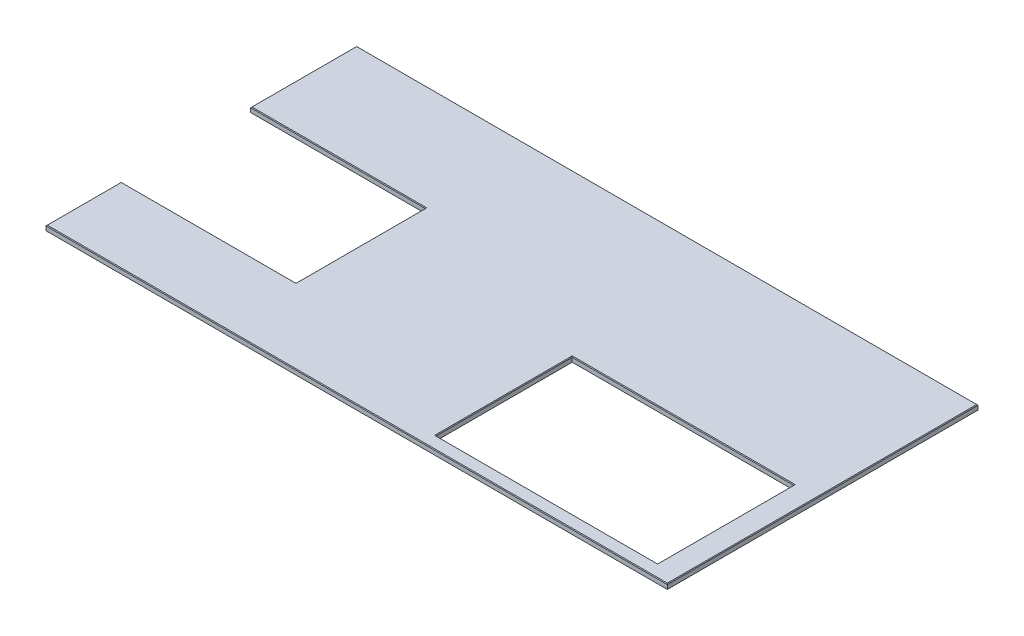
ISO-10303-21;
HEADER;
FILE_DESCRIPTION(('STEP AP214'),'2;1');
FILE_NAME('part.step','',(''),(''),'','','');
FILE_SCHEMA(('AUTOMOTIVE_DESIGN { 1 0 10303 214 1 1 1 1 }'));
ENDSEC;
DATA;
#1=APPLICATION_CONTEXT('core data for automotive mechanical design processes');
#2=APPLICATION_PROTOCOL_DEFINITION('international standard','automotive_design',2000,#1);
#3=PRODUCT_CONTEXT('',#1,'mechanical');
#4=PRODUCT('Part','Part','',(#3));
#5=PRODUCT_RELATED_PRODUCT_CATEGORY('part','',(#4));
#6=PRODUCT_DEFINITION_FORMATION('','',#4);
#7=PRODUCT_DEFINITION_CONTEXT('part definition',#1,'design');
#8=PRODUCT_DEFINITION('design','',#6,#7);
#9=PRODUCT_DEFINITION_SHAPE('','',#8);
#10=(LENGTH_UNIT() NAMED_UNIT(*) SI_UNIT(.MILLI.,.METRE.));
#11=(NAMED_UNIT(*) PLANE_ANGLE_UNIT() SI_UNIT($,.RADIAN.));
#12=(NAMED_UNIT(*) SI_UNIT($,.STERADIAN.) SOLID_ANGLE_UNIT());
#13=UNCERTAINTY_MEASURE_WITH_UNIT(LENGTH_MEASURE(1.E-05),#10,'distance_accuracy_value','');
#14=(GEOMETRIC_REPRESENTATION_CONTEXT(3) GLOBAL_UNCERTAINTY_ASSIGNED_CONTEXT((#13)) GLOBAL_UNIT_ASSIGNED_CONTEXT((#10,
#11,#12)) REPRESENTATION_CONTEXT('',''));
#15=CARTESIAN_POINT('',(0.,0.,0.));
#16=DIRECTION('',(0.,0.,1.));
#17=DIRECTION('',(1.,0.,0.));
#18=AXIS2_PLACEMENT_3D('',#15,#16,#17);
#19=CARTESIAN_POINT('',(0.,-19.05,0.));
#20=DIRECTION('',(0.,0.,1.));
#21=DIRECTION('',(1.,0.,0.));
#22=AXIS2_PLACEMENT_3D('',#19,#20,#21);
#23=PLANE('',#22);
#24=DIRECTION('',(0.,1.,0.));
#25=VECTOR('',#24,1.);
#26=CARTESIAN_POINT('',(2438.4,-19.05,0.));
#27=LINE('',#26,#25);
#28=CARTESIAN_POINT('',(2438.4,-19.05,0.));
#29=VERTEX_POINT('',#28);
#30=CARTESIAN_POINT('',(2438.4,-2.53999999999999,0.));
#31=VERTEX_POINT('',#30);
#32=EDGE_CURVE('E228',#29,#31,#27,.T.);
#33=ORIENTED_EDGE('',*,*,#32,.T.);
#34=DIRECTION('',(-1.,0.,0.));
#35=VECTOR('',#34,1.);
#36=CARTESIAN_POINT('',(0.,-2.53999999999999,0.));
#37=LINE('',#36,#35);
#38=CARTESIAN_POINT('',(0.,-2.53999999999999,0.));
#39=VERTEX_POINT('',#38);
#40=EDGE_CURVE('E293',#31,#39,#37,.T.);
#41=ORIENTED_EDGE('',*,*,#40,.T.);
#42=DIRECTION('',(0.,1.,0.));
#43=VECTOR('',#42,1.);
#44=CARTESIAN_POINT('',(0.,-19.05,0.));
#45=LINE('',#44,#43);
#46=CARTESIAN_POINT('',(0.,-19.05,0.));
#47=VERTEX_POINT('',#46);
#48=EDGE_CURVE('E229',#47,#39,#45,.T.);
#49=ORIENTED_EDGE('',*,*,#48,.F.);
#50=DIRECTION('',(1.,0.,0.));
#51=VECTOR('',#50,1.);
#52=CARTESIAN_POINT('',(0.,-19.05,0.));
#53=LINE('',#52,#51);
#54=EDGE_CURVE('E201',#47,#29,#53,.T.);
#55=ORIENTED_EDGE('',*,*,#54,.T.);
#56=EDGE_LOOP('',(#33,#41,#49,#55));
#57=FACE_BOUND('',#56,.T.);
#58=ADVANCED_FACE('F40',(#57),#23,.T.);
#59=CARTESIAN_POINT('',(1.13148179390222E-13,-19.05,-295.275));
#60=DIRECTION('',(-1.,0.,0.));
#61=DIRECTION('',(0.,0.,1.));
#62=AXIS2_PLACEMENT_3D('',#59,#60,#61);
#63=PLANE('',#62);
#64=ORIENTED_EDGE('',*,*,#48,.T.);
#65=DIRECTION('',(0.,0.,-1.));
#66=VECTOR('',#65,1.);
#67=CARTESIAN_POINT('',(1.13148179390222E-13,-2.53999999999999,-295.275));
#68=LINE('',#67,#66);
#69=CARTESIAN_POINT('',(1.13148179390222E-13,-2.53999999999999,-295.275));
#70=VERTEX_POINT('',#69);
#71=EDGE_CURVE('E278',#39,#70,#68,.T.);
#72=ORIENTED_EDGE('',*,*,#71,.T.);
#73=DIRECTION('',(0.,1.,0.));
#74=VECTOR('',#73,1.);
#75=CARTESIAN_POINT('',(1.13148179390222E-13,-19.05,-295.275));
#76=LINE('',#75,#74);
#77=CARTESIAN_POINT('',(1.13148179390222E-13,-19.05,-295.275));
#78=VERTEX_POINT('',#77);
#79=EDGE_CURVE('E233',#78,#70,#76,.T.);
#80=ORIENTED_EDGE('',*,*,#79,.F.);
#81=DIRECTION('',(0.,0.,1.));
#82=VECTOR('',#81,1.);
#83=CARTESIAN_POINT('',(1.13148179390222E-13,-19.05,-295.275));
#84=LINE('',#83,#82);
#85=EDGE_CURVE('E225',#78,#47,#84,.T.);
#86=ORIENTED_EDGE('',*,*,#85,.T.);
#87=EDGE_LOOP('',(#64,#72,#80,#86));
#88=FACE_BOUND('',#87,.T.);
#89=ADVANCED_FACE('F351',(#88),#63,.T.);
#90=CARTESIAN_POINT('',(1.13148179390222E-13,-19.05,-295.275));
#91=DIRECTION('',(0.,0.,-1.));
#92=DIRECTION('',(-1.,0.,0.));
#93=AXIS2_PLACEMENT_3D('',#90,#91,#92);
#94=PLANE('',#93);
#95=ORIENTED_EDGE('',*,*,#79,.T.);
#96=DIRECTION('',(1.,0.,0.));
#97=VECTOR('',#96,1.);
#98=CARTESIAN_POINT('',(1.13148179390222E-13,-2.53999999999999,-295.275));
#99=LINE('',#98,#97);
#100=CARTESIAN_POINT('',(685.8,-2.53999999999999,-295.275));
#101=VERTEX_POINT('',#100);
#102=EDGE_CURVE('E281',#70,#101,#99,.T.);
#103=ORIENTED_EDGE('',*,*,#102,.T.);
#104=DIRECTION('',(0.,1.,0.));
#105=VECTOR('',#104,1.);
#106=CARTESIAN_POINT('',(685.8,-19.05,-295.275));
#107=LINE('',#106,#105);
#108=CARTESIAN_POINT('',(685.8,-19.05,-295.275));
#109=VERTEX_POINT('',#108);
#110=EDGE_CURVE('E236',#109,#101,#107,.T.);
#111=ORIENTED_EDGE('',*,*,#110,.F.);
#112=DIRECTION('',(-1.,0.,0.));
#113=VECTOR('',#112,1.);
#114=CARTESIAN_POINT('',(1.13148179390222E-13,-19.05,-295.275));
#115=LINE('',#114,#113);
#116=EDGE_CURVE('E222',#109,#78,#115,.T.);
#117=ORIENTED_EDGE('',*,*,#116,.T.);
#118=EDGE_LOOP('',(#95,#103,#111,#117));
#119=FACE_BOUND('',#118,.T.);
#120=ADVANCED_FACE('F358',(#119),#94,.T.);
#121=CARTESIAN_POINT('',(685.8,-19.05,-803.275));
#122=DIRECTION('',(-1.,0.,0.));
#123=DIRECTION('',(0.,0.,1.));
#124=AXIS2_PLACEMENT_3D('',#121,#122,#123);
#125=PLANE('',#124);
#126=ORIENTED_EDGE('',*,*,#110,.T.);
#127=DIRECTION('',(0.,0.,-1.));
#128=VECTOR('',#127,1.);
#129=CARTESIAN_POINT('',(685.8,-2.53999999999999,-803.275));
#130=LINE('',#129,#128);
#131=CARTESIAN_POINT('',(685.8,-2.53999999999999,-803.275));
#132=VERTEX_POINT('',#131);
#133=EDGE_CURVE('E283',#101,#132,#130,.T.);
#134=ORIENTED_EDGE('',*,*,#133,.T.);
#135=DIRECTION('',(0.,1.,0.));
#136=VECTOR('',#135,1.);
#137=CARTESIAN_POINT('',(685.8,-19.05,-803.275));
#138=LINE('',#137,#136);
#139=CARTESIAN_POINT('',(685.8,-19.05,-803.275));
#140=VERTEX_POINT('',#139);
#141=EDGE_CURVE('E239',#140,#132,#138,.T.);
#142=ORIENTED_EDGE('',*,*,#141,.F.);
#143=DIRECTION('',(0.,0.,1.));
#144=VECTOR('',#143,1.);
#145=CARTESIAN_POINT('',(685.8,-19.05,-803.275));
#146=LINE('',#145,#144);
#147=EDGE_CURVE('E219',#140,#109,#146,.T.);
#148=ORIENTED_EDGE('',*,*,#147,.T.);
#149=EDGE_LOOP('',(#126,#134,#142,#148));
#150=FACE_BOUND('',#149,.T.);
#151=ADVANCED_FACE('F555',(#150),#125,.T.);
#152=CARTESIAN_POINT('',(0.,-19.05,-803.275));
#153=DIRECTION('',(0.,0.,1.));
#154=DIRECTION('',(1.,0.,0.));
#155=AXIS2_PLACEMENT_3D('',#152,#153,#154);
#156=PLANE('',#155);
#157=ORIENTED_EDGE('',*,*,#141,.T.);
#158=DIRECTION('',(-1.,0.,0.));
#159=VECTOR('',#158,1.);
#160=CARTESIAN_POINT('',(0.,-2.53999999999999,-803.275));
#161=LINE('',#160,#159);
#162=CARTESIAN_POINT('',(0.,-2.53999999999999,-803.275));
#163=VERTEX_POINT('',#162);
#164=EDGE_CURVE('E285',#132,#163,#161,.T.);
#165=ORIENTED_EDGE('',*,*,#164,.T.);
#166=DIRECTION('',(0.,1.,0.));
#167=VECTOR('',#166,1.);
#168=CARTESIAN_POINT('',(0.,-19.05,-803.275));
#169=LINE('',#168,#167);
#170=CARTESIAN_POINT('',(0.,-19.05,-803.275));
#171=VERTEX_POINT('',#170);
#172=EDGE_CURVE('E242',#171,#163,#169,.T.);
#173=ORIENTED_EDGE('',*,*,#172,.F.);
#174=DIRECTION('',(1.,0.,0.));
#175=VECTOR('',#174,1.);
#176=CARTESIAN_POINT('',(0.,-19.05,-803.275));
#177=LINE('',#176,#175);
#178=EDGE_CURVE('E216',#171,#140,#177,.T.);
#179=ORIENTED_EDGE('',*,*,#178,.T.);
#180=EDGE_LOOP('',(#157,#165,#173,#179));
#181=FACE_BOUND('',#180,.T.);
#182=ADVANCED_FACE('F545',(#181),#156,.T.);
#183=CARTESIAN_POINT('',(-2.29534139493609E-13,-19.05,-1219.2));
#184=DIRECTION('',(-1.,0.,0.));
#185=DIRECTION('',(0.,0.,1.));
#186=AXIS2_PLACEMENT_3D('',#183,#184,#185);
#187=PLANE('',#186);
#188=ORIENTED_EDGE('',*,*,#172,.T.);
#189=DIRECTION('',(0.,0.,-1.));
#190=VECTOR('',#189,1.);
#191=CARTESIAN_POINT('',(-2.29534139493609E-13,-2.53999999999999,-1219.2));
#192=LINE('',#191,#190);
#193=CARTESIAN_POINT('',(-2.29534139493609E-13,-2.53999999999999,-1219.2));
#194=VERTEX_POINT('',#193);
#195=EDGE_CURVE('E287',#163,#194,#192,.T.);
#196=ORIENTED_EDGE('',*,*,#195,.T.);
#197=DIRECTION('',(0.,1.,0.));
#198=VECTOR('',#197,1.);
#199=CARTESIAN_POINT('',(-2.29534139493609E-13,-19.05,-1219.2));
#200=LINE('',#199,#198);
#201=CARTESIAN_POINT('',(-2.29534139493609E-13,-19.05,-1219.2));
#202=VERTEX_POINT('',#201);
#203=EDGE_CURVE('E245',#202,#194,#200,.T.);
#204=ORIENTED_EDGE('',*,*,#203,.F.);
#205=DIRECTION('',(0.,0.,1.));
#206=VECTOR('',#205,1.);
#207=CARTESIAN_POINT('',(-2.29534139493609E-13,-19.05,-1219.2));
#208=LINE('',#207,#206);
#209=EDGE_CURVE('E213',#202,#171,#208,.T.);
#210=ORIENTED_EDGE('',*,*,#209,.T.);
#211=EDGE_LOOP('',(#188,#196,#204,#210));
#212=FACE_BOUND('',#211,.T.);
#213=ADVANCED_FACE('F536',(#212),#187,.T.);
#214=CARTESIAN_POINT('',(2438.4,-19.05,-1219.2));
#215=DIRECTION('',(0.,0.,-1.));
#216=DIRECTION('',(-1.,0.,0.));
#217=AXIS2_PLACEMENT_3D('',#214,#215,#216);
#218=PLANE('',#217);
#219=ORIENTED_EDGE('',*,*,#203,.T.);
#220=DIRECTION('',(1.,0.,0.));
#221=VECTOR('',#220,1.);
#222=CARTESIAN_POINT('',(2438.4,-2.53999999999999,-1219.2));
#223=LINE('',#222,#221);
#224=CARTESIAN_POINT('',(2438.4,-2.53999999999999,-1219.2));
#225=VERTEX_POINT('',#224);
#226=EDGE_CURVE('E289',#194,#225,#223,.T.);
#227=ORIENTED_EDGE('',*,*,#226,.T.);
#228=DIRECTION('',(0.,1.,0.));
#229=VECTOR('',#228,1.);
#230=CARTESIAN_POINT('',(2438.4,-19.05,-1219.2));
#231=LINE('',#230,#229);
#232=CARTESIAN_POINT('',(2438.4,-19.05,-1219.2));
#233=VERTEX_POINT('',#232);
#234=EDGE_CURVE('E248',#233,#225,#231,.T.);
#235=ORIENTED_EDGE('',*,*,#234,.F.);
#236=DIRECTION('',(-1.,0.,0.));
#237=VECTOR('',#236,1.);
#238=CARTESIAN_POINT('',(2438.4,-19.05,-1219.2));
#239=LINE('',#238,#237);
#240=EDGE_CURVE('E210',#233,#202,#239,.T.);
#241=ORIENTED_EDGE('',*,*,#240,.T.);
#242=EDGE_LOOP('',(#219,#227,#235,#241));
#243=FACE_BOUND('',#242,.T.);
#244=ADVANCED_FACE('F527',(#243),#218,.T.);
#245=CARTESIAN_POINT('',(2438.4,-19.05,0.));
#246=DIRECTION('',(1.,0.,0.));
#247=DIRECTION('',(0.,0.,-1.));
#248=AXIS2_PLACEMENT_3D('',#245,#246,#247);
#249=PLANE('',#248);
#250=ORIENTED_EDGE('',*,*,#234,.T.);
#251=DIRECTION('',(0.,0.,1.));
#252=VECTOR('',#251,1.);
#253=CARTESIAN_POINT('',(2438.4,-2.53999999999999,0.));
#254=LINE('',#253,#252);
#255=EDGE_CURVE('E291',#225,#31,#254,.T.);
#256=ORIENTED_EDGE('',*,*,#255,.T.);
#257=ORIENTED_EDGE('',*,*,#32,.F.);
#258=DIRECTION('',(0.,0.,-1.));
#259=VECTOR('',#258,1.);
#260=CARTESIAN_POINT('',(2438.4,-19.05,0.));
#261=LINE('',#260,#259);
#262=EDGE_CURVE('E207',#29,#233,#261,.T.);
#263=ORIENTED_EDGE('',*,*,#262,.T.);
#264=EDGE_LOOP('',(#250,#256,#257,#263));
#265=FACE_BOUND('',#264,.T.);
#266=ADVANCED_FACE('F363',(#265),#249,.T.);
#267=CARTESIAN_POINT('',(0.,-19.05,0.));
#268=DIRECTION('',(0.,1.,0.));
#269=DIRECTION('',(0.,0.,1.));
#270=AXIS2_PLACEMENT_3D('',#267,#268,#269);
#271=PLANE('',#270);
#272=DIRECTION('',(0.,0.,-1.));
#273=VECTOR('',#272,1.);
#274=CARTESIAN_POINT('',(2349.4365,-19.05,-585.724));
#275=LINE('',#274,#273);
#276=CARTESIAN_POINT('',(2349.4365,-19.05,-50.8));
#277=VERTEX_POINT('',#276);
#278=CARTESIAN_POINT('',(2349.4365,-19.05,-585.724));
#279=VERTEX_POINT('',#278);
#280=EDGE_CURVE('E178',#277,#279,#275,.T.);
#281=ORIENTED_EDGE('',*,*,#280,.T.);
#282=DIRECTION('',(-1.,0.,0.));
#283=VECTOR('',#282,1.);
#284=CARTESIAN_POINT('',(1479.4865,-19.05,-585.724));
#285=LINE('',#284,#283);
#286=CARTESIAN_POINT('',(1479.4865,-19.05,-585.724));
#287=VERTEX_POINT('',#286);
#288=EDGE_CURVE('E171',#279,#287,#285,.T.);
#289=ORIENTED_EDGE('',*,*,#288,.T.);
#290=DIRECTION('',(0.,0.,1.));
#291=VECTOR('',#290,1.);
#292=CARTESIAN_POINT('',(1479.4865,-19.05,-50.8));
#293=LINE('',#292,#291);
#294=CARTESIAN_POINT('',(1479.4865,-19.05,-50.8));
#295=VERTEX_POINT('',#294);
#296=EDGE_CURVE('E182',#287,#295,#293,.T.);
#297=ORIENTED_EDGE('',*,*,#296,.T.);
#298=DIRECTION('',(1.,0.,0.));
#299=VECTOR('',#298,1.);
#300=CARTESIAN_POINT('',(1479.4865,-19.05,-50.8));
#301=LINE('',#300,#299);
#302=EDGE_CURVE('E186',#295,#277,#301,.T.);
#303=ORIENTED_EDGE('',*,*,#302,.T.);
#304=EDGE_LOOP('',(#281,#289,#297,#303));
#305=FACE_BOUND('',#304,.T.);
#306=ORIENTED_EDGE('',*,*,#54,.F.);
#307=ORIENTED_EDGE('',*,*,#85,.F.);
#308=ORIENTED_EDGE('',*,*,#116,.F.);
#309=ORIENTED_EDGE('',*,*,#147,.F.);
#310=ORIENTED_EDGE('',*,*,#178,.F.);
#311=ORIENTED_EDGE('',*,*,#209,.F.);
#312=ORIENTED_EDGE('',*,*,#240,.F.);
#313=ORIENTED_EDGE('',*,*,#262,.F.);
#314=EDGE_LOOP('',(#306,#307,#308,#309,#310,#311,#312,#313));
#315=FACE_BOUND('',#314,.T.);
#316=ADVANCED_FACE('F188',(#305,#315),#271,.F.);
#317=CARTESIAN_POINT('',(0.,0.,0.));
#318=DIRECTION('',(0.,1.,0.));
#319=DIRECTION('',(0.,0.,1.));
#320=AXIS2_PLACEMENT_3D('',#317,#318,#319);
#321=PLANE('',#320);
#322=DIRECTION('',(-1.,0.,0.));
#323=VECTOR('',#322,1.);
#324=CARTESIAN_POINT('',(0.,0.,-292.735));
#325=LINE('',#324,#323);
#326=CARTESIAN_POINT('',(688.34,0.,-292.735));
#327=VERTEX_POINT('',#326);
#328=CARTESIAN_POINT('',(2.5400000000001,0.,-292.735));
#329=VERTEX_POINT('',#328);
#330=EDGE_CURVE('E273',#327,#329,#325,.T.);
#331=ORIENTED_EDGE('',*,*,#330,.T.);
#332=DIRECTION('',(0.,0.,1.));
#333=VECTOR('',#332,1.);
#334=CARTESIAN_POINT('',(2.53999999999999,0.,0.));
#335=LINE('',#334,#333);
#336=CARTESIAN_POINT('',(2.53999999999999,0.,-2.53999999999999));
#337=VERTEX_POINT('',#336);
#338=EDGE_CURVE('E275',#329,#337,#335,.T.);
#339=ORIENTED_EDGE('',*,*,#338,.T.);
#340=DIRECTION('',(1.,0.,0.));
#341=VECTOR('',#340,1.);
#342=CARTESIAN_POINT('',(0.,0.,-2.53999999999999));
#343=LINE('',#342,#341);
#344=CARTESIAN_POINT('',(2435.86,0.,-2.53999999999999));
#345=VERTEX_POINT('',#344);
#346=EDGE_CURVE('E261',#337,#345,#343,.T.);
#347=ORIENTED_EDGE('',*,*,#346,.T.);
#348=DIRECTION('',(0.,0.,-1.));
#349=VECTOR('',#348,1.);
#350=CARTESIAN_POINT('',(2435.86,0.,0.));
#351=LINE('',#350,#349);
#352=CARTESIAN_POINT('',(2435.86,0.,-1216.66));
#353=VERTEX_POINT('',#352);
#354=EDGE_CURVE('E263',#345,#353,#351,.T.);
#355=ORIENTED_EDGE('',*,*,#354,.T.);
#356=DIRECTION('',(-1.,0.,0.));
#357=VECTOR('',#356,1.);
#358=CARTESIAN_POINT('',(0.,0.,-1216.66));
#359=LINE('',#358,#357);
#360=CARTESIAN_POINT('',(2.53999999999976,0.,-1216.66));
#361=VERTEX_POINT('',#360);
#362=EDGE_CURVE('E265',#353,#361,#359,.T.);
#363=ORIENTED_EDGE('',*,*,#362,.T.);
#364=DIRECTION('',(0.,0.,1.));
#365=VECTOR('',#364,1.);
#366=CARTESIAN_POINT('',(2.54000000000058,0.,0.));
#367=LINE('',#366,#365);
#368=CARTESIAN_POINT('',(2.54000000000004,0.,-805.815));
#369=VERTEX_POINT('',#368);
#370=EDGE_CURVE('E267',#361,#369,#367,.T.);
#371=ORIENTED_EDGE('',*,*,#370,.T.);
#372=DIRECTION('',(1.,0.,0.));
#373=VECTOR('',#372,1.);
#374=CARTESIAN_POINT('',(0.,0.,-805.815));
#375=LINE('',#374,#373);
#376=CARTESIAN_POINT('',(688.34,0.,-805.815));
#377=VERTEX_POINT('',#376);
#378=EDGE_CURVE('E269',#369,#377,#375,.T.);
#379=ORIENTED_EDGE('',*,*,#378,.T.);
#380=DIRECTION('',(0.,0.,1.));
#381=VECTOR('',#380,1.);
#382=CARTESIAN_POINT('',(688.34,0.,-1.50435219836709E-13));
#383=LINE('',#382,#381);
#384=EDGE_CURVE('E271',#377,#327,#383,.T.);
#385=ORIENTED_EDGE('',*,*,#384,.T.);
#386=EDGE_LOOP('',(#331,#339,#347,#355,#363,#371,#379,#385));
#387=FACE_BOUND('',#386,.T.);
#388=DIRECTION('',(-1.,0.,0.));
#389=VECTOR('',#388,1.);
#390=CARTESIAN_POINT('',(1479.4865,0.,-48.26));
#391=LINE('',#390,#389);
#392=CARTESIAN_POINT('',(2351.9765,0.,-48.26));
#393=VERTEX_POINT('',#392);
#394=CARTESIAN_POINT('',(1476.9465,0.,-48.26));
#395=VERTEX_POINT('',#394);
#396=EDGE_CURVE('E256',#393,#395,#391,.T.);
#397=ORIENTED_EDGE('',*,*,#396,.T.);
#398=DIRECTION('',(0.,0.,-1.));
#399=VECTOR('',#398,1.);
#400=CARTESIAN_POINT('',(1476.9465,0.,-585.724));
#401=LINE('',#400,#399);
#402=CARTESIAN_POINT('',(1476.9465,0.,-588.264));
#403=VERTEX_POINT('',#402);
#404=EDGE_CURVE('E258',#395,#403,#401,.T.);
#405=ORIENTED_EDGE('',*,*,#404,.T.);
#406=DIRECTION('',(1.,0.,0.));
#407=VECTOR('',#406,1.);
#408=CARTESIAN_POINT('',(2349.4365,0.,-588.264));
#409=LINE('',#408,#407);
#410=CARTESIAN_POINT('',(2351.9765,0.,-588.264));
#411=VERTEX_POINT('',#410);
#412=EDGE_CURVE('E232',#403,#411,#409,.T.);
#413=ORIENTED_EDGE('',*,*,#412,.T.);
#414=DIRECTION('',(0.,0.,1.));
#415=VECTOR('',#414,1.);
#416=CARTESIAN_POINT('',(2351.9765,0.,-50.8));
#417=LINE('',#416,#415);
#418=EDGE_CURVE('E254',#411,#393,#417,.T.);
#419=ORIENTED_EDGE('',*,*,#418,.T.);
#420=EDGE_LOOP('',(#397,#405,#413,#419));
#421=FACE_BOUND('',#420,.T.);
#422=ADVANCED_FACE('F333',(#387,#421),#321,.T.);
#423=CARTESIAN_POINT('',(1479.4865,-19.05,-585.724));
#424=DIRECTION('',(0.,0.,-1.));
#425=DIRECTION('',(-1.,0.,0.));
#426=AXIS2_PLACEMENT_3D('',#423,#424,#425);
#427=PLANE('',#426);
#428=DIRECTION('',(0.,1.,0.));
#429=VECTOR('',#428,1.);
#430=CARTESIAN_POINT('',(2349.4365,-19.05,-585.724));
#431=LINE('',#430,#429);
#432=CARTESIAN_POINT('',(2349.4365,-2.53999999999999,-585.724));
#433=VERTEX_POINT('',#432);
#434=EDGE_CURVE('E199',#279,#433,#431,.T.);
#435=ORIENTED_EDGE('',*,*,#434,.T.);
#436=DIRECTION('',(-1.,0.,0.));
#437=VECTOR('',#436,1.);
#438=CARTESIAN_POINT('',(1479.4865,-2.53999999999999,-585.724));
#439=LINE('',#438,#437);
#440=CARTESIAN_POINT('',(1479.4865,-2.53999999999999,-585.724));
#441=VERTEX_POINT('',#440);
#442=EDGE_CURVE('E11',#433,#441,#439,.T.);
#443=ORIENTED_EDGE('',*,*,#442,.T.);
#444=DIRECTION('',(0.,1.,0.));
#445=VECTOR('',#444,1.);
#446=CARTESIAN_POINT('',(1479.4865,-19.05,-585.724));
#447=LINE('',#446,#445);
#448=EDGE_CURVE('E167',#287,#441,#447,.T.);
#449=ORIENTED_EDGE('',*,*,#448,.F.);
#450=ORIENTED_EDGE('',*,*,#288,.F.);
#451=EDGE_LOOP('',(#435,#443,#449,#450));
#452=FACE_BOUND('',#451,.T.);
#453=ADVANCED_FACE('F169',(#452),#427,.F.);
#454=CARTESIAN_POINT('',(2349.4365,-19.05,-585.724));
#455=DIRECTION('',(1.,0.,0.));
#456=DIRECTION('',(0.,0.,-1.));
#457=AXIS2_PLACEMENT_3D('',#454,#455,#456);
#458=PLANE('',#457);
#459=DIRECTION('',(0.,1.,0.));
#460=VECTOR('',#459,1.);
#461=CARTESIAN_POINT('',(2349.4365,-19.05,-50.8));
#462=LINE('',#461,#460);
#463=CARTESIAN_POINT('',(2349.4365,-2.53999999999999,-50.8));
#464=VERTEX_POINT('',#463);
#465=EDGE_CURVE('E202',#277,#464,#462,.T.);
#466=ORIENTED_EDGE('',*,*,#465,.T.);
#467=DIRECTION('',(0.,0.,-1.));
#468=VECTOR('',#467,1.);
#469=CARTESIAN_POINT('',(2349.4365,-2.53999999999999,-585.724));
#470=LINE('',#469,#468);
#471=EDGE_CURVE('E50',#464,#433,#470,.T.);
#472=ORIENTED_EDGE('',*,*,#471,.T.);
#473=ORIENTED_EDGE('',*,*,#434,.F.);
#474=ORIENTED_EDGE('',*,*,#280,.F.);
#475=EDGE_LOOP('',(#466,#472,#473,#474));
#476=FACE_BOUND('',#475,.T.);
#477=ADVANCED_FACE('F341',(#476),#458,.F.);
#478=CARTESIAN_POINT('',(1479.4865,-19.05,-50.8));
#479=DIRECTION('',(0.,0.,1.));
#480=DIRECTION('',(1.,0.,0.));
#481=AXIS2_PLACEMENT_3D('',#478,#479,#480);
#482=PLANE('',#481);
#483=DIRECTION('',(0.,1.,0.));
#484=VECTOR('',#483,1.);
#485=CARTESIAN_POINT('',(1479.4865,-19.05,-50.8));
#486=LINE('',#485,#484);
#487=CARTESIAN_POINT('',(1479.4865,-2.53999999999999,-50.8));
#488=VERTEX_POINT('',#487);
#489=EDGE_CURVE('E177',#295,#488,#486,.T.);
#490=ORIENTED_EDGE('',*,*,#489,.T.);
#491=DIRECTION('',(1.,0.,0.));
#492=VECTOR('',#491,1.);
#493=CARTESIAN_POINT('',(2349.4365,-2.53999999999999,-50.8));
#494=LINE('',#493,#492);
#495=EDGE_CURVE('E65',#488,#464,#494,.T.);
#496=ORIENTED_EDGE('',*,*,#495,.T.);
#497=ORIENTED_EDGE('',*,*,#465,.F.);
#498=ORIENTED_EDGE('',*,*,#302,.F.);
#499=EDGE_LOOP('',(#490,#496,#497,#498));
#500=FACE_BOUND('',#499,.T.);
#501=ADVANCED_FACE('F340',(#500),#482,.F.);
#502=CARTESIAN_POINT('',(1479.4865,-19.05,-50.8));
#503=DIRECTION('',(-1.,0.,0.));
#504=DIRECTION('',(0.,0.,1.));
#505=AXIS2_PLACEMENT_3D('',#502,#503,#504);
#506=PLANE('',#505);
#507=ORIENTED_EDGE('',*,*,#448,.T.);
#508=DIRECTION('',(0.,0.,1.));
#509=VECTOR('',#508,1.);
#510=CARTESIAN_POINT('',(1479.4865,-2.53999999999999,-50.8));
#511=LINE('',#510,#509);
#512=EDGE_CURVE('E295',#441,#488,#511,.T.);
#513=ORIENTED_EDGE('',*,*,#512,.T.);
#514=ORIENTED_EDGE('',*,*,#489,.F.);
#515=ORIENTED_EDGE('',*,*,#296,.F.);
#516=EDGE_LOOP('',(#507,#513,#514,#515));
#517=FACE_BOUND('',#516,.T.);
#518=ADVANCED_FACE('F183',(#517),#506,.F.);
#519=CARTESIAN_POINT('',(2.54000000000058,0.,0.));
#520=DIRECTION('',(0.707106781186548,-0.707106781186548,0.));
#521=DIRECTION('',(0.,0.,1.));
#522=AXIS2_PLACEMENT_3D('',#519,#520,#521);
#523=PLANE('',#522);
#524=DIRECTION('',(0.577350269189626,0.577350269189626,0.577350269189626));
#525=VECTOR('',#524,1.);
#526=CARTESIAN_POINT('',(1.69333333333317,-0.846666666666586,-1217.50666666667));
#527=LINE('',#526,#525);
#528=EDGE_CURVE('E194',#194,#361,#527,.T.);
#529=ORIENTED_EDGE('',*,*,#528,.F.);
#530=ORIENTED_EDGE('',*,*,#195,.F.);
#531=DIRECTION('',(0.577350269189626,0.577350269189626,-0.577350269189626));
#532=VECTOR('',#531,1.);
#533=CARTESIAN_POINT('',(-266.065,-268.605,-537.21));
#534=LINE('',#533,#532);
#535=EDGE_CURVE('E191',#369,#163,#534,.F.);
#536=ORIENTED_EDGE('',*,*,#535,.F.);
#537=ORIENTED_EDGE('',*,*,#370,.F.);
#538=EDGE_LOOP('',(#529,#530,#536,#537));
#539=FACE_BOUND('',#538,.T.);
#540=ADVANCED_FACE('F414',(#539),#523,.F.);
#541=CARTESIAN_POINT('',(0.,0.,-805.815));
#542=DIRECTION('',(0.,-0.707106781186548,-0.707106781186548));
#543=DIRECTION('',(1.,0.,0.));
#544=AXIS2_PLACEMENT_3D('',#541,#542,#543);
#545=PLANE('',#544);
#546=ORIENTED_EDGE('',*,*,#535,.T.);
#547=ORIENTED_EDGE('',*,*,#164,.F.);
#548=DIRECTION('',(0.577350269189633,0.577350269189622,-0.577350269189622));
#549=VECTOR('',#548,1.);
#550=CARTESIAN_POINT('',(419.734999999999,-268.604999999997,-537.210000000003));
#551=LINE('',#550,#549);
#552=EDGE_CURVE('E312',#377,#132,#551,.F.);
#553=ORIENTED_EDGE('',*,*,#552,.F.);
#554=ORIENTED_EDGE('',*,*,#378,.F.);
#555=EDGE_LOOP('',(#546,#547,#553,#554));
#556=FACE_BOUND('',#555,.T.);
#557=ADVANCED_FACE('F407',(#556),#545,.F.);
#558=CARTESIAN_POINT('',(0.,0.,-1216.66));
#559=DIRECTION('',(0.,-0.707106781186548,0.707106781186548));
#560=DIRECTION('',(-1.,0.,0.));
#561=AXIS2_PLACEMENT_3D('',#558,#559,#560);
#562=PLANE('',#561);
#563=ORIENTED_EDGE('',*,*,#528,.T.);
#564=ORIENTED_EDGE('',*,*,#362,.F.);
#565=DIRECTION('',(-0.577350269189592,0.577350269189642,0.577350269189642));
#566=VECTOR('',#565,1.);
#567=CARTESIAN_POINT('',(2030.30666666668,405.553333333357,-811.106666666643));
#568=LINE('',#567,#566);
#569=EDGE_CURVE('E309',#225,#353,#568,.T.);
#570=ORIENTED_EDGE('',*,*,#569,.F.);
#571=ORIENTED_EDGE('',*,*,#226,.F.);
#572=EDGE_LOOP('',(#563,#564,#570,#571));
#573=FACE_BOUND('',#572,.T.);
#574=ADVANCED_FACE('F400',(#573),#562,.F.);
#575=CARTESIAN_POINT('',(688.34,0.,-1.50435219836709E-13));
#576=DIRECTION('',(0.707106781186541,-0.707106781186554,0.));
#577=DIRECTION('',(0.,0.,1.));
#578=AXIS2_PLACEMENT_3D('',#575,#576,#577);
#579=PLANE('',#578);
#580=ORIENTED_EDGE('',*,*,#552,.T.);
#581=ORIENTED_EDGE('',*,*,#133,.F.);
#582=DIRECTION('',(0.577350269189633,0.577350269189622,0.577350269189622));
#583=VECTOR('',#582,1.);
#584=CARTESIAN_POINT('',(458.893333333328,-229.446666666668,-522.181666666668));
#585=LINE('',#584,#583);
#586=EDGE_CURVE('E306',#327,#101,#585,.F.);
#587=ORIENTED_EDGE('',*,*,#586,.F.);
#588=ORIENTED_EDGE('',*,*,#384,.F.);
#589=EDGE_LOOP('',(#580,#581,#587,#588));
#590=FACE_BOUND('',#589,.T.);
#591=ADVANCED_FACE('F393',(#590),#579,.F.);
#592=CARTESIAN_POINT('',(2435.86,0.,0.));
#593=DIRECTION('',(-0.707106781186578,-0.707106781186517,0.));
#594=DIRECTION('',(0.,0.,-1.));
#595=AXIS2_PLACEMENT_3D('',#592,#593,#594);
#596=PLANE('',#595);
#597=ORIENTED_EDGE('',*,*,#569,.T.);
#598=ORIENTED_EDGE('',*,*,#354,.F.);
#599=DIRECTION('',(-0.577350269189592,0.577350269189642,-0.577350269189642));
#600=VECTOR('',#599,1.);
#601=CARTESIAN_POINT('',(1623.90666666676,811.95333333331,-814.49333333331));
#602=LINE('',#601,#600);
#603=EDGE_CURVE('E303',#31,#345,#602,.T.);
#604=ORIENTED_EDGE('',*,*,#603,.F.);
#605=ORIENTED_EDGE('',*,*,#255,.F.);
#606=EDGE_LOOP('',(#597,#598,#604,#605));
#607=FACE_BOUND('',#606,.T.);
#608=ADVANCED_FACE('F386',(#607),#596,.F.);
#609=CARTESIAN_POINT('',(0.,0.,-292.735));
#610=DIRECTION('',(0.,-0.707106781186548,0.707106781186548));
#611=DIRECTION('',(-1.,0.,0.));
#612=AXIS2_PLACEMENT_3D('',#609,#610,#611);
#613=PLANE('',#612);
#614=ORIENTED_EDGE('',*,*,#586,.T.);
#615=ORIENTED_EDGE('',*,*,#102,.F.);
#616=DIRECTION('',(0.577350269189626,0.577350269189626,0.577350269189626));
#617=VECTOR('',#616,1.);
#618=CARTESIAN_POINT('',(1.69333333333341,-0.846666666666692,-293.581666666667));
#619=LINE('',#618,#617);
#620=EDGE_CURVE('E301',#329,#70,#619,.F.);
#621=ORIENTED_EDGE('',*,*,#620,.F.);
#622=ORIENTED_EDGE('',*,*,#330,.F.);
#623=EDGE_LOOP('',(#614,#615,#621,#622));
#624=FACE_BOUND('',#623,.T.);
#625=ADVANCED_FACE('F379',(#624),#613,.F.);
#626=CARTESIAN_POINT('',(0.,0.,-2.53999999999999));
#627=DIRECTION('',(0.,-0.707106781186548,-0.707106781186548));
#628=DIRECTION('',(1.,0.,0.));
#629=AXIS2_PLACEMENT_3D('',#626,#627,#628);
#630=PLANE('',#629);
#631=ORIENTED_EDGE('',*,*,#603,.T.);
#632=ORIENTED_EDGE('',*,*,#346,.F.);
#633=DIRECTION('',(-0.577350269189626,-0.577350269189626,0.577350269189626));
#634=VECTOR('',#633,1.);
#635=CARTESIAN_POINT('',(1.69333333333332,-0.846666666666663,-1.69333333333332));
#636=LINE('',#635,#634);
#637=EDGE_CURVE('E299',#39,#337,#636,.F.);
#638=ORIENTED_EDGE('',*,*,#637,.F.);
#639=ORIENTED_EDGE('',*,*,#40,.F.);
#640=EDGE_LOOP('',(#631,#632,#638,#639));
#641=FACE_BOUND('',#640,.T.);
#642=ADVANCED_FACE('F372',(#641),#630,.F.);
#643=CARTESIAN_POINT('',(2.53999999999999,0.,0.));
#644=DIRECTION('',(0.707106781186548,-0.707106781186548,0.));
#645=DIRECTION('',(0.,0.,1.));
#646=AXIS2_PLACEMENT_3D('',#643,#644,#645);
#647=PLANE('',#646);
#648=ORIENTED_EDGE('',*,*,#620,.T.);
#649=ORIENTED_EDGE('',*,*,#71,.F.);
#650=ORIENTED_EDGE('',*,*,#637,.T.);
#651=ORIENTED_EDGE('',*,*,#338,.F.);
#652=EDGE_LOOP('',(#648,#649,#650,#651));
#653=FACE_BOUND('',#652,.T.);
#654=ADVANCED_FACE('F366',(#653),#647,.F.);
#655=CARTESIAN_POINT('',(2349.4365,-2.53999999999999,-585.724));
#656=DIRECTION('',(-0.707106781186578,0.707106781186517,0.));
#657=DIRECTION('',(0.,0.,1.));
#658=AXIS2_PLACEMENT_3D('',#655,#656,#657);
#659=PLANE('',#658);
#660=DIRECTION('',(0.577350269189592,0.577350269189642,0.577350269189643));
#661=VECTOR('',#660,1.);
#662=CARTESIAN_POINT('',(2059.4531666667,-292.523333333325,-340.783333333325));
#663=LINE('',#662,#661);
#664=EDGE_CURVE('E320',#393,#464,#663,.F.);
#665=ORIENTED_EDGE('',*,*,#664,.F.);
#666=ORIENTED_EDGE('',*,*,#418,.F.);
#667=DIRECTION('',(0.577350269189592,0.577350269189642,-0.577350269189642));
#668=VECTOR('',#667,1.);
#669=CARTESIAN_POINT('',(2349.4365,-2.53999999999999,-585.724));
#670=LINE('',#669,#668);
#671=EDGE_CURVE('E45',#433,#411,#670,.T.);
#672=ORIENTED_EDGE('',*,*,#671,.F.);
#673=ORIENTED_EDGE('',*,*,#471,.F.);
#674=EDGE_LOOP('',(#665,#666,#672,#673));
#675=FACE_BOUND('',#674,.T.);
#676=ADVANCED_FACE('F43',(#675),#659,.T.);
#677=CARTESIAN_POINT('',(1479.4865,-2.53999999999999,-585.724));
#678=DIRECTION('',(0.,0.707106781186548,0.707106781186548));
#679=DIRECTION('',(1.,0.,0.));
#680=AXIS2_PLACEMENT_3D('',#677,#678,#679);
#681=PLANE('',#680);
#682=ORIENTED_EDGE('',*,*,#671,.T.);
#683=ORIENTED_EDGE('',*,*,#412,.F.);
#684=DIRECTION('',(0.577350269189626,-0.577350269189626,0.577350269189626));
#685=VECTOR('',#684,1.);
#686=CARTESIAN_POINT('',(1657.7945,-180.848,-407.416));
#687=LINE('',#686,#685);
#688=EDGE_CURVE('E319',#441,#403,#687,.F.);
#689=ORIENTED_EDGE('',*,*,#688,.F.);
#690=ORIENTED_EDGE('',*,*,#442,.F.);
#691=EDGE_LOOP('',(#682,#683,#689,#690));
#692=FACE_BOUND('',#691,.T.);
#693=ADVANCED_FACE('F329',(#692),#681,.T.);
#694=CARTESIAN_POINT('',(1479.4865,-2.53999999999999,-50.8));
#695=DIRECTION('',(0.,0.707106781186548,-0.707106781186547));
#696=DIRECTION('',(-1.,0.,0.));
#697=AXIS2_PLACEMENT_3D('',#694,#695,#696);
#698=PLANE('',#697);
#699=ORIENTED_EDGE('',*,*,#664,.T.);
#700=ORIENTED_EDGE('',*,*,#495,.F.);
#701=DIRECTION('',(-0.577350269189626,0.577350269189626,0.577350269189626));
#702=VECTOR('',#701,1.);
#703=CARTESIAN_POINT('',(1479.4865,-2.53999999999999,-50.8));
#704=LINE('',#703,#702);
#705=EDGE_CURVE('E317',#395,#488,#704,.F.);
#706=ORIENTED_EDGE('',*,*,#705,.F.);
#707=ORIENTED_EDGE('',*,*,#396,.F.);
#708=EDGE_LOOP('',(#699,#700,#706,#707));
#709=FACE_BOUND('',#708,.T.);
#710=ADVANCED_FACE('F339',(#709),#698,.T.);
#711=CARTESIAN_POINT('',(1479.4865,-2.53999999999999,-50.8));
#712=DIRECTION('',(0.707106781186548,0.707106781186548,0.));
#713=DIRECTION('',(0.,0.,-1.));
#714=AXIS2_PLACEMENT_3D('',#711,#712,#713);
#715=PLANE('',#714);
#716=ORIENTED_EDGE('',*,*,#688,.T.);
#717=ORIENTED_EDGE('',*,*,#404,.F.);
#718=ORIENTED_EDGE('',*,*,#705,.T.);
#719=ORIENTED_EDGE('',*,*,#512,.F.);
#720=EDGE_LOOP('',(#716,#717,#718,#719));
#721=FACE_BOUND('',#720,.T.);
#722=ADVANCED_FACE('F337',(#721),#715,.T.);
#723=CLOSED_SHELL('',(#58,#89,#120,#151,#182,#213,#244,#266,#316,#422,#453,#477,#501,#518,#540,
#557,#574,#591,#608,#625,#642,#654,#676,#693,#710,#722));
#724=MANIFOLD_SOLID_BREP('B2',#723);
#725=ADVANCED_BREP_SHAPE_REPRESENTATION('',(#18,#724),#14);
#726=SHAPE_DEFINITION_REPRESENTATION(#9,#725);
ENDSEC;
END-ISO-10303-21;
